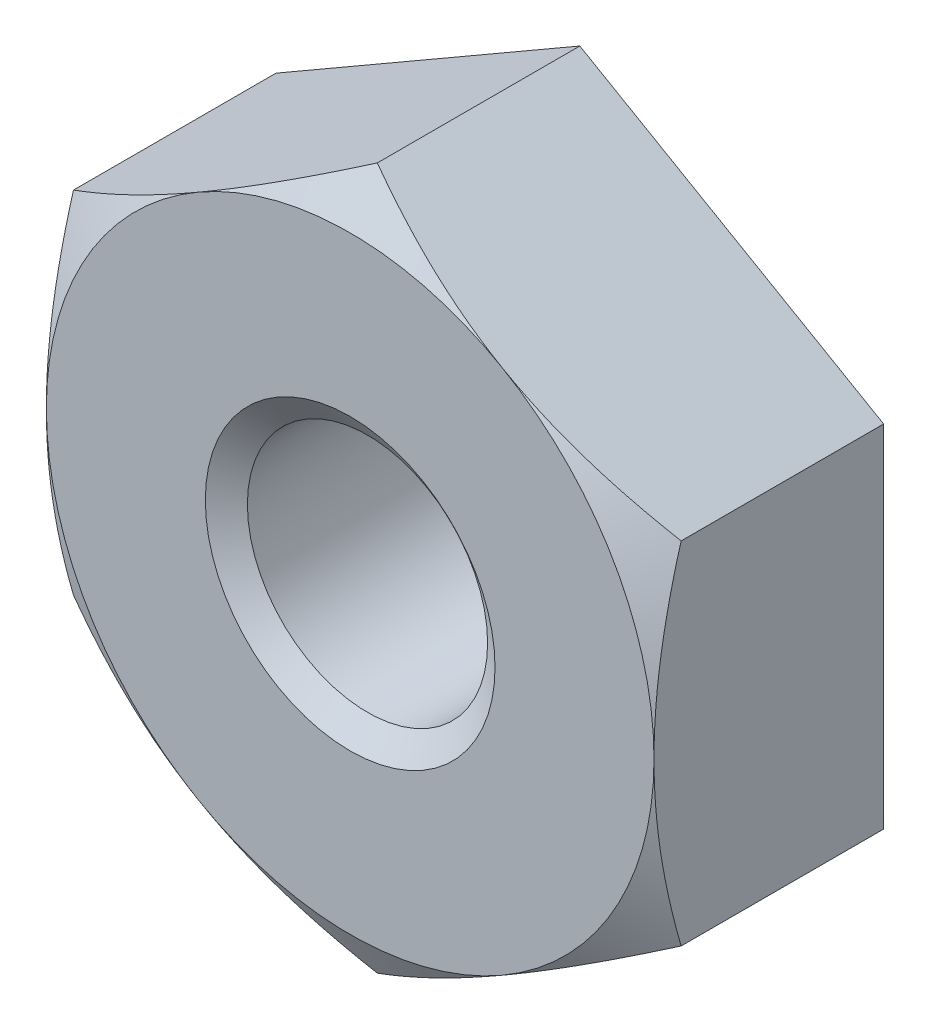
ISO-10303-21;
HEADER;
FILE_DESCRIPTION(('STEP AP214'),'2;1');
FILE_NAME('part.step','',(''),(''),'','','');
FILE_SCHEMA(('AUTOMOTIVE_DESIGN { 1 0 10303 214 1 1 1 1 }'));
ENDSEC;
DATA;
#1=APPLICATION_CONTEXT('core data for automotive mechanical design processes');
#2=APPLICATION_PROTOCOL_DEFINITION('international standard','automotive_design',2000,#1);
#3=PRODUCT_CONTEXT('',#1,'mechanical');
#4=PRODUCT('Part','Part','',(#3));
#5=PRODUCT_RELATED_PRODUCT_CATEGORY('part','',(#4));
#6=PRODUCT_DEFINITION_FORMATION('','',#4);
#7=PRODUCT_DEFINITION_CONTEXT('part definition',#1,'design');
#8=PRODUCT_DEFINITION('design','',#6,#7);
#9=PRODUCT_DEFINITION_SHAPE('','',#8);
#10=(LENGTH_UNIT() NAMED_UNIT(*) SI_UNIT(.MILLI.,.METRE.));
#11=(NAMED_UNIT(*) PLANE_ANGLE_UNIT() SI_UNIT($,.RADIAN.));
#12=(NAMED_UNIT(*) SI_UNIT($,.STERADIAN.) SOLID_ANGLE_UNIT());
#13=UNCERTAINTY_MEASURE_WITH_UNIT(LENGTH_MEASURE(1.E-05),#10,'distance_accuracy_value','');
#14=(GEOMETRIC_REPRESENTATION_CONTEXT(3) GLOBAL_UNCERTAINTY_ASSIGNED_CONTEXT((#13)) GLOBAL_UNIT_ASSIGNED_CONTEXT((#10,
#11,#12)) REPRESENTATION_CONTEXT('',''));
#15=CARTESIAN_POINT('',(0.,0.,0.));
#16=DIRECTION('',(0.,0.,1.));
#17=DIRECTION('',(1.,0.,0.));
#18=AXIS2_PLACEMENT_3D('',#15,#16,#17);
#19=CARTESIAN_POINT('',(0.,0.,-3.302));
#20=DIRECTION('',(0.,0.,1.));
#21=DIRECTION('',(1.,0.,0.));
#22=AXIS2_PLACEMENT_3D('',#19,#20,#21);
#23=CYLINDRICAL_SURFACE('',#22,1.7272);
#24=CARTESIAN_POINT('',(0.,0.,-0.248993800587372));
#25=DIRECTION('',(0.,0.,1.));
#26=DIRECTION('',(1.,0.,0.));
#27=AXIS2_PLACEMENT_3D('',#24,#25,#26);
#28=CIRCLE('',#27,1.7272);
#29=CARTESIAN_POINT('',(1.7272,0.,-0.248993800587372));
#30=VERTEX_POINT('',#29);
#31=EDGE_CURVE('E134',#30,#30,#28,.F.);
#32=ORIENTED_EDGE('',*,*,#31,.F.);
#33=EDGE_LOOP('',(#32));
#34=FACE_BOUND('',#33,.T.);
#35=CARTESIAN_POINT('',(0.,0.,-3.02760619941263));
#36=DIRECTION('',(0.,0.,-1.));
#37=DIRECTION('',(-1.,0.,0.));
#38=AXIS2_PLACEMENT_3D('',#35,#36,#37);
#39=CIRCLE('',#38,1.7272);
#40=CARTESIAN_POINT('',(-1.7272,0.,-3.02760619941263));
#41=VERTEX_POINT('',#40);
#42=EDGE_CURVE('E40',#41,#41,#39,.F.);
#43=ORIENTED_EDGE('',*,*,#42,.F.);
#44=EDGE_LOOP('',(#43));
#45=FACE_BOUND('',#44,.T.);
#46=ADVANCED_FACE('F35',(#34,#45),#23,.F.);
#47=CARTESIAN_POINT('',(0.,5.04465571207128,-3.302));
#48=DIRECTION('',(-0.500000000000001,0.866025403784438,0.));
#49=DIRECTION('',(-0.866025403784438,-0.500000000000001,0.));
#50=AXIS2_PLACEMENT_3D('',#47,#48,#49);
#51=PLANE('',#50);
#52=DIRECTION('',(0.,0.,1.));
#53=VECTOR('',#52,1.);
#54=CARTESIAN_POINT('',(-4.3688,2.52232785603563,-3.302));
#55=LINE('',#54,#53);
#56=CARTESIAN_POINT('',(-4.3688,2.52232785603563,-3.302));
#57=VERTEX_POINT('',#56);
#58=CARTESIAN_POINT('',(-4.3688,2.52232785603563,-0.3902054772977));
#59=VERTEX_POINT('',#58);
#60=EDGE_CURVE('E231',#57,#59,#55,.T.);
#61=ORIENTED_EDGE('',*,*,#60,.T.);
#62=CARTESIAN_POINT('',(-4.369,2.52221238598179,-0.390272146253268));
#63=CARTESIAN_POINT('',(-4.17701432322195,2.63305536815015,-0.326254019345325));
#64=CARTESIAN_POINT('',(-3.98337143625713,2.74485514106595,-0.268032047091907));
#65=CARTESIAN_POINT('',(-3.59273259013828,2.97039058402859,-0.166405423750635));
#66=CARTESIAN_POINT('',(-3.39572969030934,3.08413026127597,-0.123036723706271));
#67=CARTESIAN_POINT('',(-3.00416535018124,3.31020003845398,-0.0555275892763375));
#68=CARTESIAN_POINT('',(-2.8096641539418,3.42249535646053,-0.0309378363235527));
#69=CARTESIAN_POINT('',(-2.41974664983152,3.64761433242035,-0.00158375292556967));
#70=CARTESIAN_POINT('',(-2.22433175903685,3.76043717222432,0.0032048862619142));
#71=CARTESIAN_POINT('',(-1.85919363799043,3.97124976470186,-0.0067615441074548));
#72=CARTESIAN_POINT('',(-1.6894157250961,4.06927108841386,-0.0190695182980124));
#73=CARTESIAN_POINT('',(-1.35096599187974,4.26467513299348,-0.058077204428766));
#74=CARTESIAN_POINT('',(-1.18229534203414,4.36205717808622,-0.0847902391814814));
#75=CARTESIAN_POINT('',(-0.843147890127902,4.55786405073927,-0.151570221556089));
#76=CARTESIAN_POINT('',(-0.67271400871229,4.6562640980536,-0.191920224220218));
#77=CARTESIAN_POINT('',(-0.33438810815201,4.8515966478159,-0.283498656513235));
#78=CARTESIAN_POINT('',(-0.166491755144837,4.94853165242055,-0.334705570816539));
#79=CARTESIAN_POINT('',(0.00019999999999923,5.04477118212511,-0.390272146253271));
#80=B_SPLINE_CURVE_WITH_KNOTS('',3,(#62,#63,#64,#65,#66,#67,#68,#69,#70,#71,#72,#73,#74,#75,#76,
#77,#78,#79),.UNSPECIFIED.,.F.,.F.,(4,2,2,2,2,2,2,2,4),(0.,0.692505588180071,1.38667567200999,
2.06366565456448,2.73982428641929,3.32854996891366,3.91782108250885,4.5201625585125,
5.12132133857944),.UNSPECIFIED.);
#81=CARTESIAN_POINT('',(-2.18440000000001,3.78349178405345,0.));
#82=VERTEX_POINT('',#81);
#83=EDGE_CURVE('E120',#59,#82,#80,.T.);
#84=ORIENTED_EDGE('',*,*,#83,.T.);
#85=CARTESIAN_POINT('',(0.,5.04465571207128,-0.390205477297699));
#86=VERTEX_POINT('',#85);
#87=EDGE_CURVE('E146',#82,#86,#80,.T.);
#88=ORIENTED_EDGE('',*,*,#87,.T.);
#89=DIRECTION('',(0.,0.,1.));
#90=VECTOR('',#89,1.);
#91=CARTESIAN_POINT('',(0.,5.04465571207128,-3.302));
#92=LINE('',#91,#90);
#93=CARTESIAN_POINT('',(0.,5.04465571207128,-3.302));
#94=VERTEX_POINT('',#93);
#95=EDGE_CURVE('E243',#94,#86,#92,.T.);
#96=ORIENTED_EDGE('',*,*,#95,.F.);
#97=DIRECTION('',(-0.866025403784438,-0.500000000000001,0.));
#98=VECTOR('',#97,1.);
#99=CARTESIAN_POINT('',(0.,5.04465571207128,-3.302));
#100=LINE('',#99,#98);
#101=EDGE_CURVE('E259',#94,#57,#100,.T.);
#102=ORIENTED_EDGE('',*,*,#101,.T.);
#103=EDGE_LOOP('',(#61,#84,#88,#96,#102));
#104=FACE_BOUND('',#103,.T.);
#105=ADVANCED_FACE('F37',(#104),#51,.T.);
#106=CARTESIAN_POINT('',(4.3688,2.52232785603564,-3.302));
#107=DIRECTION('',(0.500000000000001,0.866025403784438,0.));
#108=DIRECTION('',(-0.866025403784438,0.500000000000001,0.));
#109=AXIS2_PLACEMENT_3D('',#106,#107,#108);
#110=PLANE('',#109);
#111=ORIENTED_EDGE('',*,*,#95,.T.);
#112=CARTESIAN_POINT('',(-0.000200000000001309,5.04477118212511,-0.390272146253271));
#113=CARTESIAN_POINT('',(0.191785676778044,4.93392819995676,-0.326254019345328));
#114=CARTESIAN_POINT('',(0.385428563742872,4.82212842704096,-0.268032047091909));
#115=CARTESIAN_POINT('',(0.776067409861722,4.59659298407831,-0.166405423750637));
#116=CARTESIAN_POINT('',(0.973070309690659,4.48285330683094,-0.123036723706273));
#117=CARTESIAN_POINT('',(1.36463464981876,4.25678352965293,-0.0555275892763391));
#118=CARTESIAN_POINT('',(1.5591358460582,4.14448821164638,-0.030937836323554));
#119=CARTESIAN_POINT('',(1.94905335016848,3.91936923568656,-0.00158375292557046));
#120=CARTESIAN_POINT('',(2.14446824096316,3.80654639588259,0.00320488626191354));
#121=CARTESIAN_POINT('',(2.50960636200957,3.59573380340505,-0.00676154410745539));
#122=CARTESIAN_POINT('',(2.67938427490391,3.49771247969305,-0.019069518298013));
#123=CARTESIAN_POINT('',(3.01783400812026,3.30230843511343,-0.0580772044287658));
#124=CARTESIAN_POINT('',(3.18650465796586,3.20492639002069,-0.0847902391814804));
#125=CARTESIAN_POINT('',(3.5256521098721,3.00911951736764,-0.151570221556088));
#126=CARTESIAN_POINT('',(3.69608599128771,2.91071947005331,-0.191920224220216));
#127=CARTESIAN_POINT('',(4.03441189184799,2.71538692029101,-0.283498656513234));
#128=CARTESIAN_POINT('',(4.20230824485516,2.61845191568636,-0.334705570816538));
#129=CARTESIAN_POINT('',(4.369,2.5222123859818,-0.390272146253269));
#130=B_SPLINE_CURVE_WITH_KNOTS('',3,(#112,#113,#114,#115,#116,#117,#118,#119,#120,#121,#122,
#123,#124,#125,#126,#127,#128,#129),.UNSPECIFIED.,.F.,.F.,(4,2,2,2,2,2,2,2,4),(0.,
0.692505588180072,1.38667567200999,2.06366565456448,2.73982428641929,3.32854996891367,
3.91782108250886,4.5201625585125,5.12132133857944),.UNSPECIFIED.);
#131=CARTESIAN_POINT('',(2.1844,3.78349178405345,0.));
#132=VERTEX_POINT('',#131);
#133=EDGE_CURVE('E142',#86,#132,#130,.T.);
#134=ORIENTED_EDGE('',*,*,#133,.T.);
#135=CARTESIAN_POINT('',(4.3688,2.52232785603564,-0.390205477297699));
#136=VERTEX_POINT('',#135);
#137=EDGE_CURVE('E129',#132,#136,#130,.T.);
#138=ORIENTED_EDGE('',*,*,#137,.T.);
#139=DIRECTION('',(0.,0.,1.));
#140=VECTOR('',#139,1.);
#141=CARTESIAN_POINT('',(4.3688,2.52232785603564,-3.302));
#142=LINE('',#141,#140);
#143=CARTESIAN_POINT('',(4.3688,2.52232785603564,-3.302));
#144=VERTEX_POINT('',#143);
#145=EDGE_CURVE('E141',#144,#136,#142,.T.);
#146=ORIENTED_EDGE('',*,*,#145,.F.);
#147=DIRECTION('',(-0.866025403784438,0.5,0.));
#148=VECTOR('',#147,1.);
#149=CARTESIAN_POINT('',(4.3688,2.52232785603564,-3.302));
#150=LINE('',#149,#148);
#151=EDGE_CURVE('E235',#144,#94,#150,.T.);
#152=ORIENTED_EDGE('',*,*,#151,.T.);
#153=EDGE_LOOP('',(#111,#134,#138,#146,#152));
#154=FACE_BOUND('',#153,.T.);
#155=ADVANCED_FACE('F211',(#154),#110,.T.);
#156=CARTESIAN_POINT('',(4.3688,2.52232785603564,-3.302));
#157=DIRECTION('',(-1.,0.,0.));
#158=DIRECTION('',(0.,0.,1.));
#159=AXIS2_PLACEMENT_3D('',#156,#157,#158);
#160=PLANE('',#159);
#161=CARTESIAN_POINT('',(4.3688,-6.68958518743313,-2.09058747015903));
#162=CARTESIAN_POINT('',(4.3688,-6.49777016317985,-1.99789185471359));
#163=CARTESIAN_POINT('',(4.3688,-6.30550162360646,-1.90611771072942));
#164=CARTESIAN_POINT('',(4.3688,-5.919812301523,-1.7249389254409));
#165=CARTESIAN_POINT('',(4.3688,-5.72639132652265,-1.63553469438958));
#166=CARTESIAN_POINT('',(4.3688,-5.33710707680669,-1.45915130833322));
#167=CARTESIAN_POINT('',(4.3688,-5.14123615996685,-1.37218895887827));
#168=CARTESIAN_POINT('',(4.3688,-4.74788442913253,-1.20199950616559));
#169=CARTESIAN_POINT('',(4.3688,-4.55040369969016,-1.11877220820663));
#170=CARTESIAN_POINT('',(4.3688,-4.15106673826398,-0.956057977466858));
#171=CARTESIAN_POINT('',(4.3688,-3.94918655341588,-0.876629508962582));
#172=CARTESIAN_POINT('',(4.3688,-3.54304484348439,-0.723993430313052));
#173=CARTESIAN_POINT('',(4.3688,-3.338783056327,-0.65078651228273));
#174=CARTESIAN_POINT('',(4.3688,-2.92797339248016,-0.512560407179517));
#175=CARTESIAN_POINT('',(4.3688,-2.72143143217471,-0.447523813031698));
#176=CARTESIAN_POINT('',(4.3688,-2.30540922017469,-0.327751192809323));
#177=CARTESIAN_POINT('',(4.3688,-2.09592992027346,-0.27301190932798));
#178=CARTESIAN_POINT('',(4.3688,-1.67389951675793,-0.176488903460131));
#179=CARTESIAN_POINT('',(4.3688,-1.46134761097217,-0.13470863065931));
#180=CARTESIAN_POINT('',(4.3688,-1.03365293078833,-0.0669258210586632));
#181=CARTESIAN_POINT('',(4.3688,-0.818510154099769,-0.0409232982083516));
#182=CARTESIAN_POINT('',(4.3688,-0.495449298048832,-0.0154234920898188));
#183=CARTESIAN_POINT('',(4.3688,-0.38803908099844,-0.00917291776942587));
#184=CARTESIAN_POINT('',(4.3688,-0.173053157711787,-0.00121763636852822));
#185=CARTESIAN_POINT('',(4.3688,-0.0654774536427616,0.000487129745749073));
#186=CARTESIAN_POINT('',(4.3688,0.257152191545762,-0.00132501851328305));
#187=CARTESIAN_POINT('',(4.3688,0.472211053929907,-0.0117601656507523));
#188=CARTESIAN_POINT('',(4.3688,0.839428709857252,-0.0446463142807151));
#189=CARTESIAN_POINT('',(4.3688,0.992000760315655,-0.062811656846004));
#190=CARTESIAN_POINT('',(4.3688,1.29596699062512,-0.10726976718274));
#191=CARTESIAN_POINT('',(4.3688,1.44736101064885,-0.133563618724753));
#192=CARTESIAN_POINT('',(4.3688,1.89965396000277,-0.223261837826227));
#193=CARTESIAN_POINT('',(4.3688,2.19843156204362,-0.297459397479416));
#194=CARTESIAN_POINT('',(4.3688,2.64550767125623,-0.425429796477862));
#195=CARTESIAN_POINT('',(4.3688,2.79613613241495,-0.471517975005144));
#196=CARTESIAN_POINT('',(4.3688,3.09582081741505,-0.568254810771603));
#197=CARTESIAN_POINT('',(4.3688,3.24487804754844,-0.618900322497454));
#198=CARTESIAN_POINT('',(4.3688,3.54079706259956,-0.723697946842163));
#199=CARTESIAN_POINT('',(4.3688,3.68766648253473,-0.777828717406924));
#200=CARTESIAN_POINT('',(4.3688,3.98026581207414,-0.889267440910809));
#201=CARTESIAN_POINT('',(4.3688,4.12599523358397,-0.946576677958952));
#202=CARTESIAN_POINT('',(4.3688,4.27119772033257,-1.00516149694495));
#203=B_SPLINE_CURVE_WITH_KNOTS('',3,(#161,#162,#163,#164,#165,#166,#167,#168,#169,#170,#171,
#172,#173,#174,#175,#176,#177,#178,#179,#180,#181,#182,#183,#184,#185,#186,#187,#188,#189,#190,
#191,#192,#193,#194,#195,#196,#197,#198,#199,#200,#201,#202),.UNSPECIFIED.,.F.,.F.,(4,2,2,2,2,2,
2,2,2,2,2,2,2,2,2,2,2,2,2,2,4),(0.,0.639124631803745,1.27835918866052,1.9212518267235,
2.56411091297887,3.21486231369451,3.86568601259514,4.51509871222719,5.16430563271765,
5.813685218915,6.4630653792447,6.78575484429632,7.10844011874675,7.75350352855424,
8.21423767153292,8.67503327050771,9.59732151021674,10.0698486304712,10.5420520737689,
11.0115976388432,11.4813343033428),.UNSPECIFIED.);
#204=CARTESIAN_POINT('',(4.3688,-2.52232785603564,-0.390205477297699));
#205=VERTEX_POINT('',#204);
#206=CARTESIAN_POINT('',(4.3688,0.,0.));
#207=VERTEX_POINT('',#206);
#208=EDGE_CURVE('E109',#205,#207,#203,.T.);
#209=ORIENTED_EDGE('',*,*,#208,.F.);
#210=DIRECTION('',(0.,0.,1.));
#211=VECTOR('',#210,1.);
#212=CARTESIAN_POINT('',(4.3688,-2.52232785603564,-3.302));
#213=LINE('',#212,#211);
#214=CARTESIAN_POINT('',(4.3688,-2.52232785603564,-3.302));
#215=VERTEX_POINT('',#214);
#216=EDGE_CURVE('E240',#215,#205,#213,.T.);
#217=ORIENTED_EDGE('',*,*,#216,.F.);
#218=DIRECTION('',(0.,-1.,0.));
#219=VECTOR('',#218,1.);
#220=CARTESIAN_POINT('',(4.3688,2.52232785603564,-3.302));
#221=LINE('',#220,#219);
#222=EDGE_CURVE('E248',#144,#215,#221,.T.);
#223=ORIENTED_EDGE('',*,*,#222,.F.);
#224=ORIENTED_EDGE('',*,*,#145,.T.);
#225=EDGE_CURVE('E122',#207,#136,#203,.T.);
#226=ORIENTED_EDGE('',*,*,#225,.F.);
#227=EDGE_LOOP('',(#209,#217,#223,#224,#226));
#228=FACE_BOUND('',#227,.T.);
#229=ADVANCED_FACE('F139',(#228),#160,.F.);
#230=CARTESIAN_POINT('',(0.,-5.04465571207129,-3.302));
#231=DIRECTION('',(0.500000000000001,-0.866025403784438,0.));
#232=DIRECTION('',(0.866025403784438,0.500000000000001,0.));
#233=AXIS2_PLACEMENT_3D('',#230,#231,#232);
#234=PLANE('',#233);
#235=ORIENTED_EDGE('',*,*,#216,.T.);
#236=CARTESIAN_POINT('',(4.369,-2.5222123859818,-0.390272146253271));
#237=CARTESIAN_POINT('',(4.17701432322195,-2.63305536815016,-0.326254019345329));
#238=CARTESIAN_POINT('',(3.98337143625713,-2.74485514106596,-0.26803204709191));
#239=CARTESIAN_POINT('',(3.59273259013828,-2.97039058402861,-0.166405423750638));
#240=CARTESIAN_POINT('',(3.39572969030934,-3.08413026127598,-0.123036723706274));
#241=CARTESIAN_POINT('',(3.00416535018124,-3.310200038454,-0.0555275892763419));
#242=CARTESIAN_POINT('',(2.8096641539418,-3.42249535646054,-0.0309378363235577));
#243=CARTESIAN_POINT('',(2.41974664983151,-3.64761433242036,-0.00158375292557518));
#244=CARTESIAN_POINT('',(2.22433175903684,-3.76043717222433,0.00320488626190873));
#245=CARTESIAN_POINT('',(1.85919363799043,-3.97124976470187,-0.00676154410746056));
#246=CARTESIAN_POINT('',(1.68941572509609,-4.06927108841387,-0.0190695182980184));
#247=CARTESIAN_POINT('',(1.35096599187974,-4.26467513299349,-0.0580772044287724));
#248=CARTESIAN_POINT('',(1.18229534203414,-4.36205717808624,-0.0847902391814879));
#249=CARTESIAN_POINT('',(0.8431478901279,-4.55786405073928,-0.151570221556096));
#250=CARTESIAN_POINT('',(0.672714008712288,-4.65626409805362,-0.191920224220224));
#251=CARTESIAN_POINT('',(0.334388108152009,-4.85159664781592,-0.283498656513241));
#252=CARTESIAN_POINT('',(0.166491755144836,-4.94853165242056,-0.334705570816546));
#253=CARTESIAN_POINT('',(-0.000199999999999065,-5.04477118212513,-0.390272146253277));
#254=B_SPLINE_CURVE_WITH_KNOTS('',3,(#236,#237,#238,#239,#240,#241,#242,#243,#244,#245,#246,
#247,#248,#249,#250,#251,#252,#253),.UNSPECIFIED.,.F.,.F.,(4,2,2,2,2,2,2,2,4),(0.,
0.692505588180073,1.38667567200999,2.06366565456448,2.73982428641929,3.32854996891367,
3.91782108250885,4.5201625585125,5.12132133857944),.UNSPECIFIED.);
#255=CARTESIAN_POINT('',(2.18440000000001,-3.78349178405345,0.));
#256=VERTEX_POINT('',#255);
#257=EDGE_CURVE('E115',#205,#256,#254,.T.);
#258=ORIENTED_EDGE('',*,*,#257,.T.);
#259=CARTESIAN_POINT('',(0.,-5.04465571207128,-0.390205477297699));
#260=VERTEX_POINT('',#259);
#261=EDGE_CURVE('E54',#256,#260,#254,.T.);
#262=ORIENTED_EDGE('',*,*,#261,.T.);
#263=DIRECTION('',(0.,0.,1.));
#264=VECTOR('',#263,1.);
#265=CARTESIAN_POINT('',(0.,-5.04465571207129,-3.302));
#266=LINE('',#265,#264);
#267=CARTESIAN_POINT('',(0.,-5.04465571207129,-3.302));
#268=VERTEX_POINT('',#267);
#269=EDGE_CURVE('E237',#268,#260,#266,.T.);
#270=ORIENTED_EDGE('',*,*,#269,.F.);
#271=DIRECTION('',(0.866025403784438,0.500000000000001,0.));
#272=VECTOR('',#271,1.);
#273=CARTESIAN_POINT('',(0.,-5.04465571207129,-3.302));
#274=LINE('',#273,#272);
#275=EDGE_CURVE('E250',#268,#215,#274,.T.);
#276=ORIENTED_EDGE('',*,*,#275,.T.);
#277=EDGE_LOOP('',(#235,#258,#262,#270,#276));
#278=FACE_BOUND('',#277,.T.);
#279=ADVANCED_FACE('F193',(#278),#234,.T.);
#280=CARTESIAN_POINT('',(-4.3688,-2.52232785603565,-3.302));
#281=DIRECTION('',(-0.500000000000001,-0.866025403784438,0.));
#282=DIRECTION('',(0.866025403784438,-0.500000000000001,0.));
#283=AXIS2_PLACEMENT_3D('',#280,#281,#282);
#284=PLANE('',#283);
#285=ORIENTED_EDGE('',*,*,#269,.T.);
#286=CARTESIAN_POINT('',(0.000200000000000876,-5.04477118212513,-0.390272146253277));
#287=CARTESIAN_POINT('',(-0.191785676778045,-4.93392819995677,-0.326254019345334));
#288=CARTESIAN_POINT('',(-0.385428563742873,-4.82212842704097,-0.268032047091915));
#289=CARTESIAN_POINT('',(-0.776067409861724,-4.59659298407832,-0.166405423750643));
#290=CARTESIAN_POINT('',(-0.973070309690661,-4.48285330683095,-0.123036723706278));
#291=CARTESIAN_POINT('',(-1.36463464981876,-4.25678352965293,-0.0555275892763449));
#292=CARTESIAN_POINT('',(-1.5591358460582,-4.14448821164639,-0.0309378363235598));
#293=CARTESIAN_POINT('',(-1.94905335016849,-3.91936923568657,-0.00158375292557589));
#294=CARTESIAN_POINT('',(-2.14446824096316,-3.8065463958826,0.00320488626190855));
#295=CARTESIAN_POINT('',(-2.50960636200958,-3.59573380340506,-0.00676154410746016));
#296=CARTESIAN_POINT('',(-2.67938427490391,-3.49771247969306,-0.0190695182980178));
#297=CARTESIAN_POINT('',(-3.01783400812027,-3.30230843511344,-0.0580772044287708));
#298=CARTESIAN_POINT('',(-3.18650465796587,-3.20492639002069,-0.0847902391814855));
#299=CARTESIAN_POINT('',(-3.5256521098721,-3.00911951736765,-0.151570221556092));
#300=CARTESIAN_POINT('',(-3.69608599128771,-2.91071947005332,-0.19192022422022));
#301=CARTESIAN_POINT('',(-4.03441189184799,-2.71538692029102,-0.283498656513237));
#302=CARTESIAN_POINT('',(-4.20230824485516,-2.61845191568637,-0.334705570816541));
#303=CARTESIAN_POINT('',(-4.369,-2.52221238598181,-0.390272146253272));
#304=B_SPLINE_CURVE_WITH_KNOTS('',3,(#286,#287,#288,#289,#290,#291,#292,#293,#294,#295,#296,
#297,#298,#299,#300,#301,#302,#303),.UNSPECIFIED.,.F.,.F.,(4,2,2,2,2,2,2,2,4),(0.,
0.692505588180074,1.38667567200999,2.06366565456448,2.73982428641929,3.32854996891367,
3.91782108250886,4.5201625585125,5.12132133857944),.UNSPECIFIED.);
#305=CARTESIAN_POINT('',(-2.1844,-3.78349178405345,0.));
#306=VERTEX_POINT('',#305);
#307=EDGE_CURVE('E187',#260,#306,#304,.T.);
#308=ORIENTED_EDGE('',*,*,#307,.T.);
#309=CARTESIAN_POINT('',(-4.3688,-2.52232785603564,-0.390205477297699));
#310=VERTEX_POINT('',#309);
#311=EDGE_CURVE('E61',#306,#310,#304,.T.);
#312=ORIENTED_EDGE('',*,*,#311,.T.);
#313=DIRECTION('',(0.,0.,1.));
#314=VECTOR('',#313,1.);
#315=CARTESIAN_POINT('',(-4.3688,-2.52232785603565,-3.302));
#316=LINE('',#315,#314);
#317=CARTESIAN_POINT('',(-4.3688,-2.52232785603565,-3.302));
#318=VERTEX_POINT('',#317);
#319=EDGE_CURVE('E234',#318,#310,#316,.T.);
#320=ORIENTED_EDGE('',*,*,#319,.F.);
#321=DIRECTION('',(0.866025403784438,-0.500000000000001,0.));
#322=VECTOR('',#321,1.);
#323=CARTESIAN_POINT('',(-4.3688,-2.52232785603565,-3.302));
#324=LINE('',#323,#322);
#325=EDGE_CURVE('E253',#318,#268,#324,.T.);
#326=ORIENTED_EDGE('',*,*,#325,.T.);
#327=EDGE_LOOP('',(#285,#308,#312,#320,#326));
#328=FACE_BOUND('',#327,.T.);
#329=ADVANCED_FACE('F189',(#328),#284,.T.);
#330=CARTESIAN_POINT('',(-4.3688,2.52232785603563,-3.302));
#331=DIRECTION('',(-1.,0.,0.));
#332=DIRECTION('',(0.,0.,1.));
#333=AXIS2_PLACEMENT_3D('',#330,#331,#332);
#334=PLANE('',#333);
#335=ORIENTED_EDGE('',*,*,#319,.T.);
#336=CARTESIAN_POINT('',(-4.3688,-6.68958518743314,-2.09058747015903));
#337=CARTESIAN_POINT('',(-4.3688,-6.49777016317985,-1.99789185471359));
#338=CARTESIAN_POINT('',(-4.3688,-6.30550162360647,-1.90611771072943));
#339=CARTESIAN_POINT('',(-4.3688,-5.919812301523,-1.7249389254409));
#340=CARTESIAN_POINT('',(-4.3688,-5.72639132652265,-1.63553469438959));
#341=CARTESIAN_POINT('',(-4.3688,-5.33710707680669,-1.45915130833322));
#342=CARTESIAN_POINT('',(-4.3688,-5.14123615996685,-1.37218895887827));
#343=CARTESIAN_POINT('',(-4.3688,-4.74788442913253,-1.20199950616559));
#344=CARTESIAN_POINT('',(-4.3688,-4.55040369969016,-1.11877220820663));
#345=CARTESIAN_POINT('',(-4.3688,-4.15106673826398,-0.956057977466859));
#346=CARTESIAN_POINT('',(-4.3688,-3.94918655341588,-0.876629508962582));
#347=CARTESIAN_POINT('',(-4.3688,-3.54304484348439,-0.723993430313053));
#348=CARTESIAN_POINT('',(-4.3688,-3.338783056327,-0.650786512282731));
#349=CARTESIAN_POINT('',(-4.3688,-2.92797339248016,-0.512560407179518));
#350=CARTESIAN_POINT('',(-4.3688,-2.72143143217471,-0.447523813031699));
#351=CARTESIAN_POINT('',(-4.3688,-2.30540922017469,-0.327751192809323));
#352=CARTESIAN_POINT('',(-4.3688,-2.09592992027346,-0.273011909327981));
#353=CARTESIAN_POINT('',(-4.3688,-1.67389951675794,-0.176488903460132));
#354=CARTESIAN_POINT('',(-4.3688,-1.46134761097217,-0.13470863065931));
#355=CARTESIAN_POINT('',(-4.3688,-1.03365293078833,-0.0669258210586636));
#356=CARTESIAN_POINT('',(-4.3688,-0.818510154099773,-0.040923298208352));
#357=CARTESIAN_POINT('',(-4.3688,-0.495449298048836,-0.0154234920898193));
#358=CARTESIAN_POINT('',(-4.3688,-0.388039080998444,-0.00917291776942645));
#359=CARTESIAN_POINT('',(-4.3688,-0.173053157711791,-0.00121763636852865));
#360=CARTESIAN_POINT('',(-4.3688,-0.0654774536427651,0.00048712974574888));
#361=CARTESIAN_POINT('',(-4.3688,0.257152191545759,-0.00132501851328266));
#362=CARTESIAN_POINT('',(-4.3688,0.472211053929905,-0.0117601656507517));
#363=CARTESIAN_POINT('',(-4.3688,0.83942870985725,-0.0446463142807147));
#364=CARTESIAN_POINT('',(-4.3688,0.992000760315653,-0.0628116568460038));
#365=CARTESIAN_POINT('',(-4.3688,1.29596699062512,-0.10726976718274));
#366=CARTESIAN_POINT('',(-4.3688,1.44736101064885,-0.133563618724753));
#367=CARTESIAN_POINT('',(-4.3688,1.89965396000277,-0.223261837826226));
#368=CARTESIAN_POINT('',(-4.3688,2.19843156204361,-0.297459397479415));
#369=CARTESIAN_POINT('',(-4.3688,2.64550767125623,-0.425429796477861));
#370=CARTESIAN_POINT('',(-4.3688,2.79613613241495,-0.471517975005144));
#371=CARTESIAN_POINT('',(-4.3688,3.09582081741505,-0.568254810771602));
#372=CARTESIAN_POINT('',(-4.3688,3.24487804754844,-0.618900322497454));
#373=CARTESIAN_POINT('',(-4.3688,3.54079706259956,-0.723697946842162));
#374=CARTESIAN_POINT('',(-4.3688,3.68766648253472,-0.777828717406923));
#375=CARTESIAN_POINT('',(-4.3688,3.98026581207413,-0.889267440910808));
#376=CARTESIAN_POINT('',(-4.3688,4.12599523358397,-0.94657667795895));
#377=CARTESIAN_POINT('',(-4.3688,4.27119772033256,-1.00516149694495));
#378=B_SPLINE_CURVE_WITH_KNOTS('',3,(#336,#337,#338,#339,#340,#341,#342,#343,#344,#345,#346,
#347,#348,#349,#350,#351,#352,#353,#354,#355,#356,#357,#358,#359,#360,#361,#362,#363,#364,#365,
#366,#367,#368,#369,#370,#371,#372,#373,#374,#375,#376,#377),.UNSPECIFIED.,.F.,.F.,(4,2,2,2,2,2,
2,2,2,2,2,2,2,2,2,2,2,2,2,2,4),(0.,0.639124631803747,1.27835918866052,1.9212518267235,
2.56411091297888,3.21486231369452,3.86568601259515,4.5150987122272,5.16430563271765,
5.81368521891501,6.4630653792447,6.78575484429632,7.10844011874676,7.75350352855425,
8.21423767153293,8.67503327050772,9.59732151021675,10.0698486304712,10.5420520737689,
11.0115976388432,11.4813343033427),.UNSPECIFIED.);
#379=CARTESIAN_POINT('',(-4.3688,0.,0.));
#380=VERTEX_POINT('',#379);
#381=EDGE_CURVE('E188',#310,#380,#378,.T.);
#382=ORIENTED_EDGE('',*,*,#381,.T.);
#383=EDGE_CURVE('E133',#380,#59,#378,.T.);
#384=ORIENTED_EDGE('',*,*,#383,.T.);
#385=ORIENTED_EDGE('',*,*,#60,.F.);
#386=DIRECTION('',(0.,-1.,0.));
#387=VECTOR('',#386,1.);
#388=CARTESIAN_POINT('',(-4.3688,2.52232785603563,-3.302));
#389=LINE('',#388,#387);
#390=EDGE_CURVE('E256',#57,#318,#389,.T.);
#391=ORIENTED_EDGE('',*,*,#390,.T.);
#392=EDGE_LOOP('',(#335,#382,#384,#385,#391));
#393=FACE_BOUND('',#392,.T.);
#394=ADVANCED_FACE('F192',(#393),#334,.T.);
#395=CARTESIAN_POINT('',(-8.73759999999999,0.,0.));
#396=DIRECTION('',(0.,0.,1.));
#397=DIRECTION('',(1.,0.,0.));
#398=AXIS2_PLACEMENT_3D('',#395,#396,#397);
#399=PLANE('',#398);
#400=CARTESIAN_POINT('',(0.,0.,0.));
#401=DIRECTION('',(0.,0.,1.));
#402=DIRECTION('',(1.,0.,0.));
#403=AXIS2_PLACEMENT_3D('',#400,#401,#402);
#404=CIRCLE('',#403,2.0828);
#405=CARTESIAN_POINT('',(2.0828,0.,0.));
#406=VERTEX_POINT('',#405);
#407=EDGE_CURVE('E219',#406,#406,#404,.T.);
#408=ORIENTED_EDGE('',*,*,#407,.F.);
#409=EDGE_LOOP('',(#408));
#410=FACE_BOUND('',#409,.T.);
#411=CARTESIAN_POINT('',(0.,0.,0.));
#412=DIRECTION('',(0.,0.,1.));
#413=DIRECTION('',(1.,0.,0.));
#414=AXIS2_PLACEMENT_3D('',#411,#412,#413);
#415=CIRCLE('',#414,4.3688);
#416=EDGE_CURVE('E11',#207,#256,#415,.F.);
#417=ORIENTED_EDGE('',*,*,#416,.F.);
#418=CARTESIAN_POINT('',(0.,0.,0.));
#419=DIRECTION('',(0.,0.,1.));
#420=DIRECTION('',(1.,0.,0.));
#421=AXIS2_PLACEMENT_3D('',#418,#419,#420);
#422=CIRCLE('',#421,4.3688);
#423=EDGE_CURVE('E126',#207,#132,#422,.T.);
#424=ORIENTED_EDGE('',*,*,#423,.T.);
#425=EDGE_CURVE('E47',#82,#132,#415,.F.);
#426=ORIENTED_EDGE('',*,*,#425,.F.);
#427=EDGE_CURVE('E286',#380,#82,#415,.F.);
#428=ORIENTED_EDGE('',*,*,#427,.F.);
#429=EDGE_CURVE('E287',#306,#380,#415,.F.);
#430=ORIENTED_EDGE('',*,*,#429,.F.);
#431=EDGE_CURVE('E45',#256,#306,#415,.F.);
#432=ORIENTED_EDGE('',*,*,#431,.F.);
#433=EDGE_LOOP('',(#417,#424,#426,#428,#430,#432));
#434=FACE_BOUND('',#433,.T.);
#435=ADVANCED_FACE('F136',(#410,#434),#399,.T.);
#436=CARTESIAN_POINT('',(-8.73759999999999,0.,-3.302));
#437=DIRECTION('',(0.,0.,1.));
#438=DIRECTION('',(1.,0.,0.));
#439=AXIS2_PLACEMENT_3D('',#436,#437,#438);
#440=PLANE('',#439);
#441=CARTESIAN_POINT('',(0.,0.,-3.302));
#442=DIRECTION('',(0.,0.,1.));
#443=DIRECTION('',(1.,0.,0.));
#444=AXIS2_PLACEMENT_3D('',#441,#442,#443);
#445=CIRCLE('',#444,2.0828);
#446=CARTESIAN_POINT('',(2.0828,0.,-3.302));
#447=VERTEX_POINT('',#446);
#448=EDGE_CURVE('E220',#447,#447,#445,.F.);
#449=ORIENTED_EDGE('',*,*,#448,.F.);
#450=EDGE_LOOP('',(#449));
#451=FACE_BOUND('',#450,.T.);
#452=ORIENTED_EDGE('',*,*,#101,.F.);
#453=ORIENTED_EDGE('',*,*,#151,.F.);
#454=ORIENTED_EDGE('',*,*,#222,.T.);
#455=ORIENTED_EDGE('',*,*,#275,.F.);
#456=ORIENTED_EDGE('',*,*,#325,.F.);
#457=ORIENTED_EDGE('',*,*,#390,.F.);
#458=EDGE_LOOP('',(#452,#453,#454,#455,#456,#457));
#459=FACE_BOUND('',#458,.T.);
#460=ADVANCED_FACE('F202',(#451,#459),#440,.F.);
#461=CARTESIAN_POINT('',(0.,0.,0.));
#462=DIRECTION('',(0.,0.,-1.));
#463=DIRECTION('',(-1.,0.,0.));
#464=AXIS2_PLACEMENT_3D('',#461,#462,#463);
#465=CONICAL_SURFACE('',#464,4.3688,1.0471975511966);
#466=ORIENTED_EDGE('',*,*,#423,.F.);
#467=ORIENTED_EDGE('',*,*,#225,.T.);
#468=ORIENTED_EDGE('',*,*,#137,.F.);
#469=EDGE_LOOP('',(#466,#467,#468));
#470=FACE_BOUND('',#469,.T.);
#471=ADVANCED_FACE('F127',(#470),#465,.T.);
#472=ORIENTED_EDGE('',*,*,#425,.T.);
#473=ORIENTED_EDGE('',*,*,#133,.F.);
#474=ORIENTED_EDGE('',*,*,#87,.F.);
#475=EDGE_LOOP('',(#472,#473,#474));
#476=FACE_BOUND('',#475,.T.);
#477=ADVANCED_FACE('F170',(#476),#465,.T.);
#478=ORIENTED_EDGE('',*,*,#383,.F.);
#479=ORIENTED_EDGE('',*,*,#427,.T.);
#480=ORIENTED_EDGE('',*,*,#83,.F.);
#481=EDGE_LOOP('',(#478,#479,#480));
#482=FACE_BOUND('',#481,.T.);
#483=ADVANCED_FACE('F169',(#482),#465,.T.);
#484=ORIENTED_EDGE('',*,*,#429,.T.);
#485=ORIENTED_EDGE('',*,*,#381,.F.);
#486=ORIENTED_EDGE('',*,*,#311,.F.);
#487=EDGE_LOOP('',(#484,#485,#486));
#488=FACE_BOUND('',#487,.T.);
#489=ADVANCED_FACE('F163',(#488),#465,.T.);
#490=ORIENTED_EDGE('',*,*,#431,.T.);
#491=ORIENTED_EDGE('',*,*,#307,.F.);
#492=ORIENTED_EDGE('',*,*,#261,.F.);
#493=EDGE_LOOP('',(#490,#491,#492));
#494=FACE_BOUND('',#493,.T.);
#495=ADVANCED_FACE('F168',(#494),#465,.T.);
#496=ORIENTED_EDGE('',*,*,#208,.T.);
#497=ORIENTED_EDGE('',*,*,#416,.T.);
#498=ORIENTED_EDGE('',*,*,#257,.F.);
#499=EDGE_LOOP('',(#496,#497,#498));
#500=FACE_BOUND('',#499,.T.);
#501=ADVANCED_FACE('F111',(#500),#465,.T.);
#502=CARTESIAN_POINT('',(0.,0.,-0.27389318064611));
#503=DIRECTION('',(0.,0.,1.));
#504=DIRECTION('',(1.,0.,0.));
#505=AXIS2_PLACEMENT_3D('',#502,#503,#504);
#506=CONICAL_SURFACE('',#505,1.69164,0.959931088596881);
#507=ORIENTED_EDGE('',*,*,#407,.T.);
#508=EDGE_LOOP('',(#507));
#509=FACE_BOUND('',#508,.T.);
#510=ORIENTED_EDGE('',*,*,#31,.T.);
#511=EDGE_LOOP('',(#510));
#512=FACE_BOUND('',#511,.T.);
#513=ADVANCED_FACE('F171',(#509,#512),#506,.F.);
#514=CARTESIAN_POINT('',(0.,0.,-3.2766));
#515=DIRECTION('',(0.,0.,-1.));
#516=DIRECTION('',(-1.,0.,0.));
#517=AXIS2_PLACEMENT_3D('',#514,#515,#516);
#518=CONICAL_SURFACE('',#517,2.0828,0.959931088596875);
#519=CARTESIAN_POINT('',(0.,0.,-3.2766));
#520=DIRECTION('',(0.,0.,1.));
#521=DIRECTION('',(1.,0.,0.));
#522=AXIS2_PLACEMENT_3D('',#519,#520,#521);
#523=CIRCLE('',#522,2.0828);
#524=CARTESIAN_POINT('',(2.0828,0.,-3.2766));
#525=VERTEX_POINT('',#524);
#526=EDGE_CURVE('E224',#525,#525,#523,.T.);
#527=ORIENTED_EDGE('',*,*,#526,.F.);
#528=EDGE_LOOP('',(#527));
#529=FACE_BOUND('',#528,.T.);
#530=ORIENTED_EDGE('',*,*,#42,.T.);
#531=EDGE_LOOP('',(#530));
#532=FACE_BOUND('',#531,.T.);
#533=ADVANCED_FACE('F300',(#529,#532),#518,.F.);
#534=CARTESIAN_POINT('',(0.,0.,-25.0375057290932));
#535=DIRECTION('',(0.,0.,1.));
#536=DIRECTION('',(1.,0.,0.));
#537=AXIS2_PLACEMENT_3D('',#534,#535,#536);
#538=CYLINDRICAL_SURFACE('',#537,2.0828);
#539=ORIENTED_EDGE('',*,*,#526,.T.);
#540=EDGE_LOOP('',(#539));
#541=FACE_BOUND('',#540,.T.);
#542=ORIENTED_EDGE('',*,*,#448,.T.);
#543=EDGE_LOOP('',(#542));
#544=FACE_BOUND('',#543,.T.);
#545=ADVANCED_FACE('F305',(#541,#544),#538,.F.);
#546=CLOSED_SHELL('',(#46,#105,#155,#229,#279,#329,#394,#435,#460,#471,#477,#483,#489,#495,#501,
#513,#533,#545));
#547=MANIFOLD_SOLID_BREP('B2',#546);
#548=ADVANCED_BREP_SHAPE_REPRESENTATION('',(#18,#547),#14);
#549=SHAPE_DEFINITION_REPRESENTATION(#9,#548);
ENDSEC;
END-ISO-10303-21;
